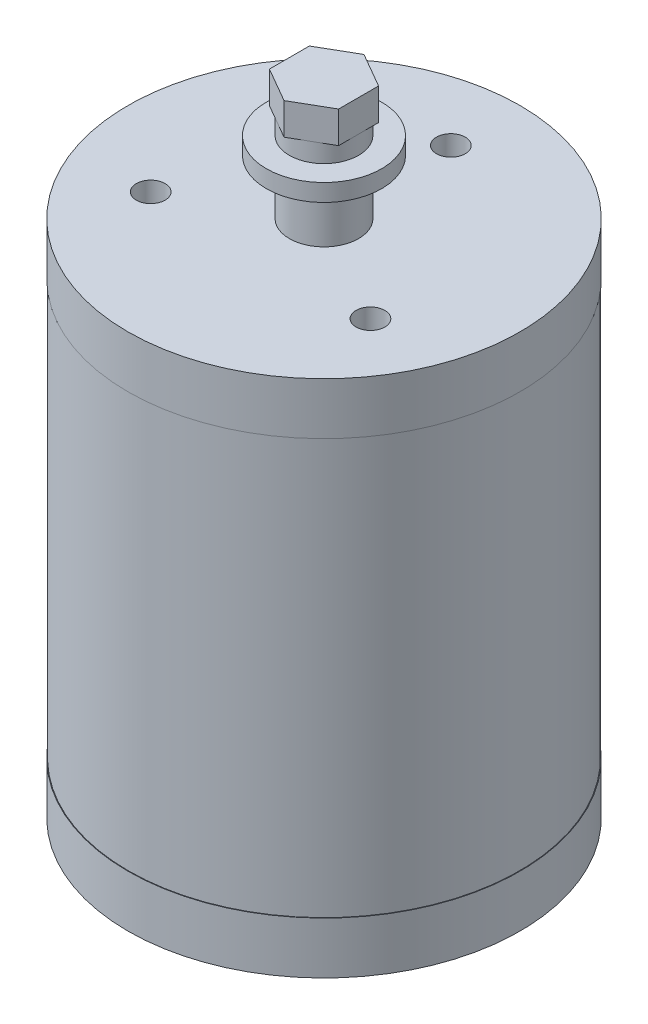
ISO-10303-21;
HEADER;
FILE_DESCRIPTION(('STEP AP214'),'2;1');
FILE_NAME('part.step','',(''),(''),'','','');
FILE_SCHEMA(('AUTOMOTIVE_DESIGN { 1 0 10303 214 1 1 1 1 }'));
ENDSEC;
DATA;
#1=APPLICATION_CONTEXT('core data for automotive mechanical design processes');
#2=APPLICATION_PROTOCOL_DEFINITION('international standard','automotive_design',2000,#1);
#3=PRODUCT_CONTEXT('',#1,'mechanical');
#4=PRODUCT('Part','Part','',(#3));
#5=PRODUCT_RELATED_PRODUCT_CATEGORY('part','',(#4));
#6=PRODUCT_DEFINITION_FORMATION('','',#4);
#7=PRODUCT_DEFINITION_CONTEXT('part definition',#1,'design');
#8=PRODUCT_DEFINITION('design','',#6,#7);
#9=PRODUCT_DEFINITION_SHAPE('','',#8);
#10=(LENGTH_UNIT() NAMED_UNIT(*) SI_UNIT(.MILLI.,.METRE.));
#11=(NAMED_UNIT(*) PLANE_ANGLE_UNIT() SI_UNIT($,.RADIAN.));
#12=(NAMED_UNIT(*) SI_UNIT($,.STERADIAN.) SOLID_ANGLE_UNIT());
#13=UNCERTAINTY_MEASURE_WITH_UNIT(LENGTH_MEASURE(1.E-05),#10,'distance_accuracy_value','');
#14=(GEOMETRIC_REPRESENTATION_CONTEXT(3) GLOBAL_UNCERTAINTY_ASSIGNED_CONTEXT((#13)) GLOBAL_UNIT_ASSIGNED_CONTEXT((#10,
#11,#12)) REPRESENTATION_CONTEXT('',''));
#15=CARTESIAN_POINT('',(0.,0.,0.));
#16=DIRECTION('',(0.,0.,1.));
#17=DIRECTION('',(1.,0.,0.));
#18=AXIS2_PLACEMENT_3D('',#15,#16,#17);
#19=CARTESIAN_POINT('',(0.,90.,0.));
#20=DIRECTION('',(0.,-1.,0.));
#21=DIRECTION('',(0.,0.,-1.));
#22=AXIS2_PLACEMENT_3D('',#19,#20,#21);
#23=CYLINDRICAL_SURFACE('',#22,34.);
#24=CARTESIAN_POINT('',(0.,81.,0.));
#25=DIRECTION('',(0.,1.,0.));
#26=DIRECTION('',(0.,0.,1.));
#27=AXIS2_PLACEMENT_3D('',#24,#25,#26);
#28=CIRCLE('',#27,34.);
#29=CARTESIAN_POINT('',(0.,81.,34.));
#30=VERTEX_POINT('',#29);
#31=EDGE_CURVE('E142',#30,#30,#28,.T.);
#32=ORIENTED_EDGE('',*,*,#31,.T.);
#33=EDGE_LOOP('',(#32));
#34=FACE_BOUND('',#33,.T.);
#35=CARTESIAN_POINT('',(0.,90.,0.));
#36=DIRECTION('',(0.,1.,0.));
#37=DIRECTION('',(0.,0.,1.));
#38=AXIS2_PLACEMENT_3D('',#35,#36,#37);
#39=CIRCLE('',#38,34.);
#40=CARTESIAN_POINT('',(0.,90.,34.));
#41=VERTEX_POINT('',#40);
#42=EDGE_CURVE('E214',#41,#41,#39,.T.);
#43=ORIENTED_EDGE('',*,*,#42,.F.);
#44=EDGE_LOOP('',(#43));
#45=FACE_BOUND('',#44,.T.);
#46=ADVANCED_FACE('F48',(#34,#45),#23,.T.);
#47=CARTESIAN_POINT('',(0.,90.,0.));
#48=DIRECTION('',(0.,1.,0.));
#49=DIRECTION('',(0.,0.,1.));
#50=AXIS2_PLACEMENT_3D('',#47,#48,#49);
#51=PLANE('',#50);
#52=CARTESIAN_POINT('',(19.0525588832576,90.,11.0000000000001));
#53=DIRECTION('',(0.,1.,0.));
#54=DIRECTION('',(-0.866025403784436,0.,-0.500000000000004));
#55=AXIS2_PLACEMENT_3D('',#52,#53,#54);
#56=CIRCLE('',#55,2.5);
#57=CARTESIAN_POINT('',(16.8874953737965,90.,9.75000000000008));
#58=VERTEX_POINT('',#57);
#59=EDGE_CURVE('E665',#58,#58,#56,.T.);
#60=ORIENTED_EDGE('',*,*,#59,.F.);
#61=EDGE_LOOP('',(#60));
#62=FACE_BOUND('',#61,.T.);
#63=CARTESIAN_POINT('',(-19.0525588832578,90.,10.9999999999998));
#64=DIRECTION('',(0.,1.,0.));
#65=DIRECTION('',(0.866025403784443,0.,-0.499999999999992));
#66=AXIS2_PLACEMENT_3D('',#63,#64,#65);
#67=CIRCLE('',#66,2.5);
#68=CARTESIAN_POINT('',(-16.8874953737966,90.,9.74999999999984));
#69=VERTEX_POINT('',#68);
#70=EDGE_CURVE('E674',#69,#69,#67,.T.);
#71=ORIENTED_EDGE('',*,*,#70,.F.);
#72=EDGE_LOOP('',(#71));
#73=FACE_BOUND('',#72,.T.);
#74=CARTESIAN_POINT('',(0.,90.,-22.));
#75=DIRECTION('',(0.,1.,0.));
#76=DIRECTION('',(0.,0.,1.));
#77=AXIS2_PLACEMENT_3D('',#74,#75,#76);
#78=CIRCLE('',#77,2.5);
#79=CARTESIAN_POINT('',(0.,90.,-19.5));
#80=VERTEX_POINT('',#79);
#81=EDGE_CURVE('E259',#80,#80,#78,.T.);
#82=ORIENTED_EDGE('',*,*,#81,.F.);
#83=EDGE_LOOP('',(#82));
#84=FACE_BOUND('',#83,.T.);
#85=CARTESIAN_POINT('',(0.,90.,0.));
#86=DIRECTION('',(0.,1.,0.));
#87=DIRECTION('',(0.,0.,1.));
#88=AXIS2_PLACEMENT_3D('',#85,#86,#87);
#89=CIRCLE('',#88,6.);
#90=CARTESIAN_POINT('',(0.,90.,6.));
#91=VERTEX_POINT('',#90);
#92=EDGE_CURVE('E205',#91,#91,#89,.T.);
#93=ORIENTED_EDGE('',*,*,#92,.F.);
#94=EDGE_LOOP('',(#93));
#95=FACE_BOUND('',#94,.T.);
#96=ORIENTED_EDGE('',*,*,#42,.T.);
#97=EDGE_LOOP('',(#96));
#98=FACE_BOUND('',#97,.T.);
#99=ADVANCED_FACE('F237',(#62,#73,#84,#95,#98),#51,.T.);
#100=CARTESIAN_POINT('',(0.,99.5,0.));
#101=DIRECTION('',(0.,-1.,0.));
#102=DIRECTION('',(0.,0.,-1.));
#103=AXIS2_PLACEMENT_3D('',#100,#101,#102);
#104=CYLINDRICAL_SURFACE('',#103,6.);
#105=CARTESIAN_POINT('',(0.,99.5,0.));
#106=DIRECTION('',(0.,1.,0.));
#107=DIRECTION('',(0.,0.,1.));
#108=AXIS2_PLACEMENT_3D('',#105,#106,#107);
#109=CIRCLE('',#108,6.);
#110=CARTESIAN_POINT('',(0.,99.5,6.));
#111=VERTEX_POINT('',#110);
#112=EDGE_CURVE('E199',#111,#111,#109,.T.);
#113=ORIENTED_EDGE('',*,*,#112,.F.);
#114=EDGE_LOOP('',(#113));
#115=FACE_BOUND('',#114,.T.);
#116=ORIENTED_EDGE('',*,*,#92,.T.);
#117=EDGE_LOOP('',(#116));
#118=FACE_BOUND('',#117,.T.);
#119=ADVANCED_FACE('F244',(#115,#118),#104,.T.);
#120=CARTESIAN_POINT('',(0.,102.5,0.));
#121=DIRECTION('',(0.,-1.,0.));
#122=DIRECTION('',(0.,0.,-1.));
#123=AXIS2_PLACEMENT_3D('',#120,#121,#122);
#124=CYLINDRICAL_SURFACE('',#123,10.);
#125=CARTESIAN_POINT('',(0.,102.5,0.));
#126=DIRECTION('',(0.,1.,0.));
#127=DIRECTION('',(0.,0.,1.));
#128=AXIS2_PLACEMENT_3D('',#125,#126,#127);
#129=CIRCLE('',#128,10.);
#130=CARTESIAN_POINT('',(0.,102.5,10.));
#131=VERTEX_POINT('',#130);
#132=EDGE_CURVE('E196',#131,#131,#129,.T.);
#133=ORIENTED_EDGE('',*,*,#132,.F.);
#134=EDGE_LOOP('',(#133));
#135=FACE_BOUND('',#134,.T.);
#136=CARTESIAN_POINT('',(0.,99.5,0.));
#137=DIRECTION('',(0.,1.,0.));
#138=DIRECTION('',(0.,0.,1.));
#139=AXIS2_PLACEMENT_3D('',#136,#137,#138);
#140=CIRCLE('',#139,10.);
#141=CARTESIAN_POINT('',(0.,99.5,10.));
#142=VERTEX_POINT('',#141);
#143=EDGE_CURVE('E195',#142,#142,#140,.T.);
#144=ORIENTED_EDGE('',*,*,#143,.T.);
#145=EDGE_LOOP('',(#144));
#146=FACE_BOUND('',#145,.T.);
#147=ADVANCED_FACE('F273',(#135,#146),#124,.T.);
#148=CARTESIAN_POINT('',(0.,102.5,0.));
#149=DIRECTION('',(0.,1.,0.));
#150=DIRECTION('',(0.,0.,1.));
#151=AXIS2_PLACEMENT_3D('',#148,#149,#150);
#152=PLANE('',#151);
#153=CARTESIAN_POINT('',(0.,102.5,0.));
#154=DIRECTION('',(0.,1.,0.));
#155=DIRECTION('',(0.,0.,1.));
#156=AXIS2_PLACEMENT_3D('',#153,#154,#155);
#157=CIRCLE('',#156,6.);
#158=CARTESIAN_POINT('',(0.,102.5,6.));
#159=VERTEX_POINT('',#158);
#160=EDGE_CURVE('E130',#159,#159,#157,.T.);
#161=ORIENTED_EDGE('',*,*,#160,.F.);
#162=EDGE_LOOP('',(#161));
#163=FACE_BOUND('',#162,.T.);
#164=ORIENTED_EDGE('',*,*,#132,.T.);
#165=EDGE_LOOP('',(#164));
#166=FACE_BOUND('',#165,.T.);
#167=ADVANCED_FACE('F269',(#163,#166),#152,.T.);
#168=CARTESIAN_POINT('',(0.,99.5,0.));
#169=DIRECTION('',(0.,1.,0.));
#170=DIRECTION('',(0.,0.,1.));
#171=AXIS2_PLACEMENT_3D('',#168,#169,#170);
#172=PLANE('',#171);
#173=ORIENTED_EDGE('',*,*,#112,.T.);
#174=EDGE_LOOP('',(#173));
#175=FACE_BOUND('',#174,.T.);
#176=ORIENTED_EDGE('',*,*,#143,.F.);
#177=EDGE_LOOP('',(#176));
#178=FACE_BOUND('',#177,.T.);
#179=ADVANCED_FACE('F272',(#175,#178),#172,.F.);
#180=CARTESIAN_POINT('',(0.,139.484271247462,0.));
#181=DIRECTION('',(0.,-1.,0.));
#182=DIRECTION('',(0.,0.,-1.));
#183=AXIS2_PLACEMENT_3D('',#180,#181,#182);
#184=CYLINDRICAL_SURFACE('',#183,6.);
#185=CARTESIAN_POINT('',(0.,105.7,0.));
#186=DIRECTION('',(0.,1.,0.));
#187=DIRECTION('',(0.,0.,1.));
#188=AXIS2_PLACEMENT_3D('',#185,#186,#187);
#189=CIRCLE('',#188,6.);
#190=CARTESIAN_POINT('',(3.,105.7,-5.19615242270663));
#191=VERTEX_POINT('',#190);
#192=CARTESIAN_POINT('',(-3.,105.7,-5.19615242270663));
#193=VERTEX_POINT('',#192);
#194=EDGE_CURVE('E349',#191,#193,#189,.T.);
#195=ORIENTED_EDGE('',*,*,#194,.F.);
#196=CARTESIAN_POINT('',(6.,105.7,0.));
#197=VERTEX_POINT('',#196);
#198=EDGE_CURVE('E148',#197,#191,#189,.T.);
#199=ORIENTED_EDGE('',*,*,#198,.F.);
#200=CARTESIAN_POINT('',(3.,105.7,5.19615242270663));
#201=VERTEX_POINT('',#200);
#202=EDGE_CURVE('E124',#201,#197,#189,.T.);
#203=ORIENTED_EDGE('',*,*,#202,.F.);
#204=CARTESIAN_POINT('',(-3.,105.7,5.19615242270663));
#205=VERTEX_POINT('',#204);
#206=EDGE_CURVE('E134',#205,#201,#189,.T.);
#207=ORIENTED_EDGE('',*,*,#206,.F.);
#208=CARTESIAN_POINT('',(-6.,105.7,0.));
#209=VERTEX_POINT('',#208);
#210=EDGE_CURVE('E141',#209,#205,#189,.T.);
#211=ORIENTED_EDGE('',*,*,#210,.F.);
#212=EDGE_CURVE('E351',#193,#209,#189,.T.);
#213=ORIENTED_EDGE('',*,*,#212,.F.);
#214=EDGE_LOOP('',(#195,#199,#203,#207,#211,#213));
#215=FACE_BOUND('',#214,.T.);
#216=ORIENTED_EDGE('',*,*,#160,.T.);
#217=EDGE_LOOP('',(#216));
#218=FACE_BOUND('',#217,.T.);
#219=ADVANCED_FACE('F146',(#215,#218),#184,.T.);
#220=CARTESIAN_POINT('',(0.,105.7,0.));
#221=DIRECTION('',(0.,1.,0.));
#222=DIRECTION('',(0.,0.,1.));
#223=AXIS2_PLACEMENT_3D('',#220,#221,#222);
#224=PLANE('',#223);
#225=DIRECTION('',(0.,0.,-1.));
#226=VECTOR('',#225,1.);
#227=CARTESIAN_POINT('',(6.,105.7,3.46410161513776));
#228=LINE('',#227,#226);
#229=CARTESIAN_POINT('',(6.,105.7,-3.46410161513776));
#230=VERTEX_POINT('',#229);
#231=EDGE_CURVE('E51',#197,#230,#228,.T.);
#232=ORIENTED_EDGE('',*,*,#231,.F.);
#233=ORIENTED_EDGE('',*,*,#198,.T.);
#234=DIRECTION('',(-0.866025403784439,0.,-0.5));
#235=VECTOR('',#234,1.);
#236=CARTESIAN_POINT('',(6.,105.7,-3.46410161513776));
#237=LINE('',#236,#235);
#238=EDGE_CURVE('E62',#230,#191,#237,.T.);
#239=ORIENTED_EDGE('',*,*,#238,.F.);
#240=EDGE_LOOP('',(#232,#233,#239));
#241=FACE_BOUND('',#240,.T.);
#242=ADVANCED_FACE('F288',(#241),#224,.F.);
#243=ORIENTED_EDGE('',*,*,#194,.T.);
#244=DIRECTION('',(-0.866025403784439,0.,0.5));
#245=VECTOR('',#244,1.);
#246=CARTESIAN_POINT('',(0.,105.7,-6.92820323027551));
#247=LINE('',#246,#245);
#248=CARTESIAN_POINT('',(0.,105.7,-6.92820323027551));
#249=VERTEX_POINT('',#248);
#250=EDGE_CURVE('E165',#249,#193,#247,.T.);
#251=ORIENTED_EDGE('',*,*,#250,.F.);
#252=EDGE_CURVE('E166',#191,#249,#237,.T.);
#253=ORIENTED_EDGE('',*,*,#252,.F.);
#254=EDGE_LOOP('',(#243,#251,#253));
#255=FACE_BOUND('',#254,.T.);
#256=ADVANCED_FACE('F321',(#255),#224,.F.);
#257=ORIENTED_EDGE('',*,*,#212,.T.);
#258=DIRECTION('',(0.,0.,1.));
#259=VECTOR('',#258,1.);
#260=CARTESIAN_POINT('',(-6.,105.7,-3.46410161513776));
#261=LINE('',#260,#259);
#262=CARTESIAN_POINT('',(-6.,105.7,-3.46410161513776));
#263=VERTEX_POINT('',#262);
#264=EDGE_CURVE('E161',#263,#209,#261,.T.);
#265=ORIENTED_EDGE('',*,*,#264,.F.);
#266=EDGE_CURVE('E162',#193,#263,#247,.T.);
#267=ORIENTED_EDGE('',*,*,#266,.F.);
#268=EDGE_LOOP('',(#257,#265,#267));
#269=FACE_BOUND('',#268,.T.);
#270=ADVANCED_FACE('F365',(#269),#224,.F.);
#271=ORIENTED_EDGE('',*,*,#210,.T.);
#272=DIRECTION('',(0.866025403784439,0.,0.5));
#273=VECTOR('',#272,1.);
#274=CARTESIAN_POINT('',(-6.,105.7,3.46410161513775));
#275=LINE('',#274,#273);
#276=CARTESIAN_POINT('',(-6.,105.7,3.46410161513775));
#277=VERTEX_POINT('',#276);
#278=EDGE_CURVE('E154',#277,#205,#275,.T.);
#279=ORIENTED_EDGE('',*,*,#278,.F.);
#280=EDGE_CURVE('E158',#209,#277,#261,.T.);
#281=ORIENTED_EDGE('',*,*,#280,.F.);
#282=EDGE_LOOP('',(#271,#279,#281));
#283=FACE_BOUND('',#282,.T.);
#284=ADVANCED_FACE('F360',(#283),#224,.F.);
#285=ORIENTED_EDGE('',*,*,#206,.T.);
#286=DIRECTION('',(0.866025403784439,0.,-0.5));
#287=VECTOR('',#286,1.);
#288=CARTESIAN_POINT('',(0.,105.7,6.92820323027551));
#289=LINE('',#288,#287);
#290=CARTESIAN_POINT('',(0.,105.7,6.92820323027551));
#291=VERTEX_POINT('',#290);
#292=EDGE_CURVE('E129',#291,#201,#289,.T.);
#293=ORIENTED_EDGE('',*,*,#292,.F.);
#294=EDGE_CURVE('E137',#205,#291,#275,.T.);
#295=ORIENTED_EDGE('',*,*,#294,.F.);
#296=EDGE_LOOP('',(#285,#293,#295));
#297=FACE_BOUND('',#296,.T.);
#298=ADVANCED_FACE('F135',(#297),#224,.F.);
#299=ORIENTED_EDGE('',*,*,#202,.T.);
#300=CARTESIAN_POINT('',(6.,105.7,3.46410161513776));
#301=VERTEX_POINT('',#300);
#302=EDGE_CURVE('E12',#301,#197,#228,.T.);
#303=ORIENTED_EDGE('',*,*,#302,.F.);
#304=EDGE_CURVE('E120',#201,#301,#289,.T.);
#305=ORIENTED_EDGE('',*,*,#304,.F.);
#306=EDGE_LOOP('',(#299,#303,#305));
#307=FACE_BOUND('',#306,.T.);
#308=ADVANCED_FACE('F122',(#307),#224,.F.);
#309=CARTESIAN_POINT('',(0.,111.2,0.));
#310=DIRECTION('',(0.,1.,0.));
#311=DIRECTION('',(0.,0.,1.));
#312=AXIS2_PLACEMENT_3D('',#309,#310,#311);
#313=PLANE('',#312);
#314=DIRECTION('',(-0.866025403784439,0.,-0.5));
#315=VECTOR('',#314,1.);
#316=CARTESIAN_POINT('',(6.,111.2,-3.46410161513776));
#317=LINE('',#316,#315);
#318=CARTESIAN_POINT('',(6.,111.2,-3.46410161513776));
#319=VERTEX_POINT('',#318);
#320=CARTESIAN_POINT('',(0.,111.2,-6.92820323027551));
#321=VERTEX_POINT('',#320);
#322=EDGE_CURVE('E169',#319,#321,#317,.T.);
#323=ORIENTED_EDGE('',*,*,#322,.T.);
#324=DIRECTION('',(-0.866025403784439,0.,0.5));
#325=VECTOR('',#324,1.);
#326=CARTESIAN_POINT('',(0.,111.2,-6.92820323027551));
#327=LINE('',#326,#325);
#328=CARTESIAN_POINT('',(-6.,111.2,-3.46410161513776));
#329=VERTEX_POINT('',#328);
#330=EDGE_CURVE('E171',#321,#329,#327,.T.);
#331=ORIENTED_EDGE('',*,*,#330,.T.);
#332=DIRECTION('',(0.,0.,1.));
#333=VECTOR('',#332,1.);
#334=CARTESIAN_POINT('',(-6.,111.2,-3.46410161513776));
#335=LINE('',#334,#333);
#336=CARTESIAN_POINT('',(-6.,111.2,3.46410161513775));
#337=VERTEX_POINT('',#336);
#338=EDGE_CURVE('E173',#329,#337,#335,.T.);
#339=ORIENTED_EDGE('',*,*,#338,.T.);
#340=DIRECTION('',(0.866025403784438,0.,0.5));
#341=VECTOR('',#340,1.);
#342=CARTESIAN_POINT('',(-6.,111.2,3.46410161513775));
#343=LINE('',#342,#341);
#344=CARTESIAN_POINT('',(0.,111.2,6.92820323027551));
#345=VERTEX_POINT('',#344);
#346=EDGE_CURVE('E175',#337,#345,#343,.T.);
#347=ORIENTED_EDGE('',*,*,#346,.T.);
#348=DIRECTION('',(0.866025403784439,0.,-0.5));
#349=VECTOR('',#348,1.);
#350=CARTESIAN_POINT('',(0.,111.2,6.92820323027551));
#351=LINE('',#350,#349);
#352=CARTESIAN_POINT('',(6.,111.2,3.46410161513776));
#353=VERTEX_POINT('',#352);
#354=EDGE_CURVE('E177',#345,#353,#351,.T.);
#355=ORIENTED_EDGE('',*,*,#354,.T.);
#356=DIRECTION('',(0.,0.,-1.));
#357=VECTOR('',#356,1.);
#358=CARTESIAN_POINT('',(6.,111.2,3.46410161513776));
#359=LINE('',#358,#357);
#360=EDGE_CURVE('E70',#353,#319,#359,.T.);
#361=ORIENTED_EDGE('',*,*,#360,.T.);
#362=EDGE_LOOP('',(#323,#331,#339,#347,#355,#361));
#363=FACE_BOUND('',#362,.T.);
#364=ADVANCED_FACE('F323',(#363),#313,.T.);
#365=CARTESIAN_POINT('',(6.,111.2,3.46410161513776));
#366=DIRECTION('',(-1.,0.,0.));
#367=DIRECTION('',(0.,0.,1.));
#368=AXIS2_PLACEMENT_3D('',#365,#366,#367);
#369=PLANE('',#368);
#370=DIRECTION('',(0.,-1.,0.));
#371=VECTOR('',#370,1.);
#372=CARTESIAN_POINT('',(6.,111.2,3.46410161513776));
#373=LINE('',#372,#371);
#374=EDGE_CURVE('E183',#353,#301,#373,.T.);
#375=ORIENTED_EDGE('',*,*,#374,.T.);
#376=ORIENTED_EDGE('',*,*,#302,.T.);
#377=ORIENTED_EDGE('',*,*,#231,.T.);
#378=DIRECTION('',(0.,-1.,0.));
#379=VECTOR('',#378,1.);
#380=CARTESIAN_POINT('',(6.,111.2,-3.46410161513776));
#381=LINE('',#380,#379);
#382=EDGE_CURVE('E180',#319,#230,#381,.T.);
#383=ORIENTED_EDGE('',*,*,#382,.F.);
#384=ORIENTED_EDGE('',*,*,#360,.F.);
#385=EDGE_LOOP('',(#375,#376,#377,#383,#384));
#386=FACE_BOUND('',#385,.T.);
#387=ADVANCED_FACE('F326',(#386),#369,.F.);
#388=CARTESIAN_POINT('',(0.,111.2,6.92820323027551));
#389=DIRECTION('',(-0.5,0.,-0.866025403784439));
#390=DIRECTION('',(-0.866025403784439,0.,0.5));
#391=AXIS2_PLACEMENT_3D('',#388,#389,#390);
#392=PLANE('',#391);
#393=DIRECTION('',(0.,-1.,0.));
#394=VECTOR('',#393,1.);
#395=CARTESIAN_POINT('',(0.,111.2,6.92820323027551));
#396=LINE('',#395,#394);
#397=EDGE_CURVE('E153',#345,#291,#396,.T.);
#398=ORIENTED_EDGE('',*,*,#397,.T.);
#399=ORIENTED_EDGE('',*,*,#292,.T.);
#400=ORIENTED_EDGE('',*,*,#304,.T.);
#401=ORIENTED_EDGE('',*,*,#374,.F.);
#402=ORIENTED_EDGE('',*,*,#354,.F.);
#403=EDGE_LOOP('',(#398,#399,#400,#401,#402));
#404=FACE_BOUND('',#403,.T.);
#405=ADVANCED_FACE('F150',(#404),#392,.F.);
#406=CARTESIAN_POINT('',(-6.,111.2,3.46410161513775));
#407=DIRECTION('',(0.5,0.,-0.866025403784438));
#408=DIRECTION('',(-0.866025403784439,0.,-0.5));
#409=AXIS2_PLACEMENT_3D('',#406,#407,#408);
#410=PLANE('',#409);
#411=DIRECTION('',(0.,-1.,0.));
#412=VECTOR('',#411,1.);
#413=CARTESIAN_POINT('',(-6.,111.2,3.46410161513775));
#414=LINE('',#413,#412);
#415=EDGE_CURVE('E186',#337,#277,#414,.T.);
#416=ORIENTED_EDGE('',*,*,#415,.T.);
#417=ORIENTED_EDGE('',*,*,#278,.T.);
#418=ORIENTED_EDGE('',*,*,#294,.T.);
#419=ORIENTED_EDGE('',*,*,#397,.F.);
#420=ORIENTED_EDGE('',*,*,#346,.F.);
#421=EDGE_LOOP('',(#416,#417,#418,#419,#420));
#422=FACE_BOUND('',#421,.T.);
#423=ADVANCED_FACE('F332',(#422),#410,.F.);
#424=CARTESIAN_POINT('',(-6.,111.2,-3.46410161513776));
#425=DIRECTION('',(1.,0.,0.));
#426=DIRECTION('',(0.,0.,-1.));
#427=AXIS2_PLACEMENT_3D('',#424,#425,#426);
#428=PLANE('',#427);
#429=DIRECTION('',(0.,-1.,0.));
#430=VECTOR('',#429,1.);
#431=CARTESIAN_POINT('',(-6.,111.2,-3.46410161513776));
#432=LINE('',#431,#430);
#433=EDGE_CURVE('E189',#329,#263,#432,.T.);
#434=ORIENTED_EDGE('',*,*,#433,.T.);
#435=ORIENTED_EDGE('',*,*,#264,.T.);
#436=ORIENTED_EDGE('',*,*,#280,.T.);
#437=ORIENTED_EDGE('',*,*,#415,.F.);
#438=ORIENTED_EDGE('',*,*,#338,.F.);
#439=EDGE_LOOP('',(#434,#435,#436,#437,#438));
#440=FACE_BOUND('',#439,.T.);
#441=ADVANCED_FACE('F335',(#440),#428,.F.);
#442=CARTESIAN_POINT('',(0.,111.2,-6.92820323027551));
#443=DIRECTION('',(0.5,0.,0.866025403784439));
#444=DIRECTION('',(0.866025403784439,0.,-0.5));
#445=AXIS2_PLACEMENT_3D('',#442,#443,#444);
#446=PLANE('',#445);
#447=DIRECTION('',(0.,-1.,0.));
#448=VECTOR('',#447,1.);
#449=CARTESIAN_POINT('',(0.,111.2,-6.92820323027551));
#450=LINE('',#449,#448);
#451=EDGE_CURVE('E192',#321,#249,#450,.T.);
#452=ORIENTED_EDGE('',*,*,#451,.T.);
#453=ORIENTED_EDGE('',*,*,#250,.T.);
#454=ORIENTED_EDGE('',*,*,#266,.T.);
#455=ORIENTED_EDGE('',*,*,#433,.F.);
#456=ORIENTED_EDGE('',*,*,#330,.F.);
#457=EDGE_LOOP('',(#452,#453,#454,#455,#456));
#458=FACE_BOUND('',#457,.T.);
#459=ADVANCED_FACE('F339',(#458),#446,.F.);
#460=CARTESIAN_POINT('',(6.,111.2,-3.46410161513776));
#461=DIRECTION('',(-0.5,0.,0.866025403784439));
#462=DIRECTION('',(0.866025403784439,0.,0.5));
#463=AXIS2_PLACEMENT_3D('',#460,#461,#462);
#464=PLANE('',#463);
#465=ORIENTED_EDGE('',*,*,#382,.T.);
#466=ORIENTED_EDGE('',*,*,#238,.T.);
#467=ORIENTED_EDGE('',*,*,#252,.T.);
#468=ORIENTED_EDGE('',*,*,#451,.F.);
#469=ORIENTED_EDGE('',*,*,#322,.F.);
#470=EDGE_LOOP('',(#465,#466,#467,#468,#469));
#471=FACE_BOUND('',#470,.T.);
#472=ADVANCED_FACE('F318',(#471),#464,.F.);
#473=CARTESIAN_POINT('',(0.,9.,0.));
#474=DIRECTION('',(0.,1.,0.));
#475=DIRECTION('',(0.,0.,1.));
#476=AXIS2_PLACEMENT_3D('',#473,#474,#475);
#477=PLANE('',#476);
#478=CARTESIAN_POINT('',(0.,9.,0.));
#479=DIRECTION('',(0.,1.,0.));
#480=DIRECTION('',(0.,0.,1.));
#481=AXIS2_PLACEMENT_3D('',#478,#479,#480);
#482=CIRCLE('',#481,34.);
#483=CARTESIAN_POINT('',(0.,9.,34.));
#484=VERTEX_POINT('',#483);
#485=EDGE_CURVE('E252',#484,#484,#482,.T.);
#486=ORIENTED_EDGE('',*,*,#485,.T.);
#487=EDGE_LOOP('',(#486));
#488=FACE_BOUND('',#487,.T.);
#489=CARTESIAN_POINT('',(0.,9.,0.));
#490=DIRECTION('',(0.,1.,0.));
#491=DIRECTION('',(0.,0.,1.));
#492=AXIS2_PLACEMENT_3D('',#489,#490,#491);
#493=CIRCLE('',#492,33.9);
#494=CARTESIAN_POINT('',(0.,9.,33.9));
#495=VERTEX_POINT('',#494);
#496=EDGE_CURVE('E255',#495,#495,#493,.T.);
#497=ORIENTED_EDGE('',*,*,#496,.F.);
#498=EDGE_LOOP('',(#497));
#499=FACE_BOUND('',#498,.T.);
#500=ADVANCED_FACE('F310',(#488,#499),#477,.T.);
#501=CARTESIAN_POINT('',(0.,186.16652224137,0.));
#502=DIRECTION('',(0.,-1.,0.));
#503=DIRECTION('',(0.,0.,-1.));
#504=AXIS2_PLACEMENT_3D('',#501,#502,#503);
#505=CYLINDRICAL_SURFACE('',#504,33.9);
#506=ORIENTED_EDGE('',*,*,#496,.T.);
#507=EDGE_LOOP('',(#506));
#508=FACE_BOUND('',#507,.T.);
#509=CARTESIAN_POINT('',(0.,81.,0.));
#510=DIRECTION('',(0.,1.,0.));
#511=DIRECTION('',(0.,0.,1.));
#512=AXIS2_PLACEMENT_3D('',#509,#510,#511);
#513=CIRCLE('',#512,33.9);
#514=CARTESIAN_POINT('',(0.,81.,33.9));
#515=VERTEX_POINT('',#514);
#516=EDGE_CURVE('E262',#515,#515,#513,.T.);
#517=ORIENTED_EDGE('',*,*,#516,.F.);
#518=EDGE_LOOP('',(#517));
#519=FACE_BOUND('',#518,.T.);
#520=ADVANCED_FACE('F302',(#508,#519),#505,.T.);
#521=CARTESIAN_POINT('',(0.,81.,0.));
#522=DIRECTION('',(0.,1.,0.));
#523=DIRECTION('',(0.,0.,1.));
#524=AXIS2_PLACEMENT_3D('',#521,#522,#523);
#525=PLANE('',#524);
#526=ORIENTED_EDGE('',*,*,#516,.T.);
#527=EDGE_LOOP('',(#526));
#528=FACE_BOUND('',#527,.T.);
#529=ORIENTED_EDGE('',*,*,#31,.F.);
#530=EDGE_LOOP('',(#529));
#531=FACE_BOUND('',#530,.T.);
#532=ADVANCED_FACE('F296',(#528,#531),#525,.F.);
#533=CARTESIAN_POINT('',(0.,-10.,0.));
#534=DIRECTION('',(0.,-1.,0.));
#535=DIRECTION('',(0.,0.,-1.));
#536=AXIS2_PLACEMENT_3D('',#533,#534,#535);
#537=PLANE('',#536);
#538=CARTESIAN_POINT('',(0.,-10.,0.));
#539=DIRECTION('',(0.,-1.,0.));
#540=DIRECTION('',(0.,0.,-1.));
#541=AXIS2_PLACEMENT_3D('',#538,#539,#540);
#542=CIRCLE('',#541,15.);
#543=CARTESIAN_POINT('',(0.,-10.,-15.));
#544=VERTEX_POINT('',#543);
#545=EDGE_CURVE('E204',#544,#544,#542,.T.);
#546=ORIENTED_EDGE('',*,*,#545,.T.);
#547=EDGE_LOOP('',(#546));
#548=FACE_BOUND('',#547,.T.);
#549=ADVANCED_FACE('F231',(#548),#537,.T.);
#550=CARTESIAN_POINT('',(0.,-10.,0.));
#551=DIRECTION('',(0.,1.,0.));
#552=DIRECTION('',(0.,0.,1.));
#553=AXIS2_PLACEMENT_3D('',#550,#551,#552);
#554=CYLINDRICAL_SURFACE('',#553,15.);
#555=ORIENTED_EDGE('',*,*,#545,.F.);
#556=EDGE_LOOP('',(#555));
#557=FACE_BOUND('',#556,.T.);
#558=CARTESIAN_POINT('',(0.,0.,0.));
#559=DIRECTION('',(0.,-1.,0.));
#560=DIRECTION('',(0.,0.,-1.));
#561=AXIS2_PLACEMENT_3D('',#558,#559,#560);
#562=CIRCLE('',#561,15.);
#563=CARTESIAN_POINT('',(0.,0.,-15.));
#564=VERTEX_POINT('',#563);
#565=EDGE_CURVE('E208',#564,#564,#562,.T.);
#566=ORIENTED_EDGE('',*,*,#565,.T.);
#567=EDGE_LOOP('',(#566));
#568=FACE_BOUND('',#567,.T.);
#569=ADVANCED_FACE('F224',(#557,#568),#554,.T.);
#570=CARTESIAN_POINT('',(0.,0.,0.));
#571=DIRECTION('',(0.,1.,0.));
#572=DIRECTION('',(0.,0.,1.));
#573=AXIS2_PLACEMENT_3D('',#570,#571,#572);
#574=PLANE('',#573);
#575=ORIENTED_EDGE('',*,*,#565,.F.);
#576=EDGE_LOOP('',(#575));
#577=FACE_BOUND('',#576,.T.);
#578=CARTESIAN_POINT('',(0.,0.,0.));
#579=DIRECTION('',(0.,1.,0.));
#580=DIRECTION('',(0.,0.,1.));
#581=AXIS2_PLACEMENT_3D('',#578,#579,#580);
#582=CIRCLE('',#581,34.);
#583=CARTESIAN_POINT('',(0.,0.,34.));
#584=VERTEX_POINT('',#583);
#585=EDGE_CURVE('E211',#584,#584,#582,.T.);
#586=ORIENTED_EDGE('',*,*,#585,.F.);
#587=EDGE_LOOP('',(#586));
#588=FACE_BOUND('',#587,.T.);
#589=ADVANCED_FACE('F222',(#577,#588),#574,.F.);
#590=ORIENTED_EDGE('',*,*,#585,.T.);
#591=EDGE_LOOP('',(#590));
#592=FACE_BOUND('',#591,.T.);
#593=ORIENTED_EDGE('',*,*,#485,.F.);
#594=EDGE_LOOP('',(#593));
#595=FACE_BOUND('',#594,.T.);
#596=ADVANCED_FACE('F219',(#592,#595),#23,.T.);
#597=CARTESIAN_POINT('',(0.,77.6,-22.));
#598=DIRECTION('',(0.,1.,0.));
#599=DIRECTION('',(0.,0.,1.));
#600=AXIS2_PLACEMENT_3D('',#597,#598,#599);
#601=CYLINDRICAL_SURFACE('',#600,2.5);
#602=CARTESIAN_POINT('',(0.,77.6,-22.));
#603=DIRECTION('',(0.,1.,0.));
#604=DIRECTION('',(0.,0.,1.));
#605=AXIS2_PLACEMENT_3D('',#602,#603,#604);
#606=CIRCLE('',#605,2.5);
#607=CARTESIAN_POINT('',(0.,77.6,-19.5));
#608=VERTEX_POINT('',#607);
#609=EDGE_CURVE('E265',#608,#608,#606,.T.);
#610=ORIENTED_EDGE('',*,*,#609,.F.);
#611=EDGE_LOOP('',(#610));
#612=FACE_BOUND('',#611,.T.);
#613=ORIENTED_EDGE('',*,*,#81,.T.);
#614=EDGE_LOOP('',(#613));
#615=FACE_BOUND('',#614,.T.);
#616=ADVANCED_FACE('F230',(#612,#615),#601,.F.);
#617=CARTESIAN_POINT('',(0.,77.6,-22.));
#618=DIRECTION('',(0.,1.,0.));
#619=DIRECTION('',(0.,0.,1.));
#620=AXIS2_PLACEMENT_3D('',#617,#618,#619);
#621=PLANE('',#620);
#622=ORIENTED_EDGE('',*,*,#609,.T.);
#623=EDGE_LOOP('',(#622));
#624=FACE_BOUND('',#623,.T.);
#625=ADVANCED_FACE('F440',(#624),#621,.T.);
#626=CARTESIAN_POINT('',(-19.0525588832578,77.6,10.9999999999998));
#627=DIRECTION('',(0.,1.,0.));
#628=DIRECTION('',(0.,0.,1.));
#629=AXIS2_PLACEMENT_3D('',#626,#627,#628);
#630=CYLINDRICAL_SURFACE('',#629,2.5);
#631=CARTESIAN_POINT('',(-19.0525588832578,77.6,10.9999999999998));
#632=DIRECTION('',(0.,1.,0.));
#633=DIRECTION('',(0.866025403784443,0.,-0.499999999999992));
#634=AXIS2_PLACEMENT_3D('',#631,#632,#633);
#635=CIRCLE('',#634,2.5);
#636=CARTESIAN_POINT('',(-16.8874953737966,77.6,9.74999999999984));
#637=VERTEX_POINT('',#636);
#638=EDGE_CURVE('E669',#637,#637,#635,.T.);
#639=ORIENTED_EDGE('',*,*,#638,.F.);
#640=EDGE_LOOP('',(#639));
#641=FACE_BOUND('',#640,.T.);
#642=ORIENTED_EDGE('',*,*,#70,.T.);
#643=EDGE_LOOP('',(#642));
#644=FACE_BOUND('',#643,.T.);
#645=ADVANCED_FACE('F447',(#641,#644),#630,.F.);
#646=CARTESIAN_POINT('',(-19.0525588832578,77.6,10.9999999999998));
#647=DIRECTION('',(0.,1.,0.));
#648=DIRECTION('',(0.866025403784443,0.,-0.499999999999992));
#649=AXIS2_PLACEMENT_3D('',#646,#647,#648);
#650=PLANE('',#649);
#651=ORIENTED_EDGE('',*,*,#638,.T.);
#652=EDGE_LOOP('',(#651));
#653=FACE_BOUND('',#652,.T.);
#654=ADVANCED_FACE('F461',(#653),#650,.T.);
#655=CARTESIAN_POINT('',(19.0525588832576,77.6,11.0000000000001));
#656=DIRECTION('',(0.,1.,0.));
#657=DIRECTION('',(0.,0.,1.));
#658=AXIS2_PLACEMENT_3D('',#655,#656,#657);
#659=CYLINDRICAL_SURFACE('',#658,2.5);
#660=CARTESIAN_POINT('',(19.0525588832576,77.6,11.0000000000001));
#661=DIRECTION('',(0.,1.,0.));
#662=DIRECTION('',(-0.866025403784436,0.,-0.500000000000004));
#663=AXIS2_PLACEMENT_3D('',#660,#661,#662);
#664=CIRCLE('',#663,2.5);
#665=CARTESIAN_POINT('',(16.8874953737965,77.6,9.75000000000008));
#666=VERTEX_POINT('',#665);
#667=EDGE_CURVE('E664',#666,#666,#664,.T.);
#668=ORIENTED_EDGE('',*,*,#667,.F.);
#669=EDGE_LOOP('',(#668));
#670=FACE_BOUND('',#669,.T.);
#671=ORIENTED_EDGE('',*,*,#59,.T.);
#672=EDGE_LOOP('',(#671));
#673=FACE_BOUND('',#672,.T.);
#674=ADVANCED_FACE('F470',(#670,#673),#659,.F.);
#675=CARTESIAN_POINT('',(19.0525588832576,77.6,11.0000000000001));
#676=DIRECTION('',(0.,1.,0.));
#677=DIRECTION('',(-0.866025403784436,0.,-0.500000000000004));
#678=AXIS2_PLACEMENT_3D('',#675,#676,#677);
#679=PLANE('',#678);
#680=ORIENTED_EDGE('',*,*,#667,.T.);
#681=EDGE_LOOP('',(#680));
#682=FACE_BOUND('',#681,.T.);
#683=ADVANCED_FACE('F479',(#682),#679,.T.);
#684=CLOSED_SHELL('',(#46,#99,#119,#147,#167,#179,#219,#242,#256,#270,#284,#298,#308,#364,#387,
#405,#423,#441,#459,#472,#500,#520,#532,#549,#569,#589,#596,#616,#625,#645,#654,#674,#683));
#685=MANIFOLD_SOLID_BREP('B2',#684);
#686=ADVANCED_BREP_SHAPE_REPRESENTATION('',(#18,#685),#14);
#687=SHAPE_DEFINITION_REPRESENTATION(#9,#686);
ENDSEC;
END-ISO-10303-21;
